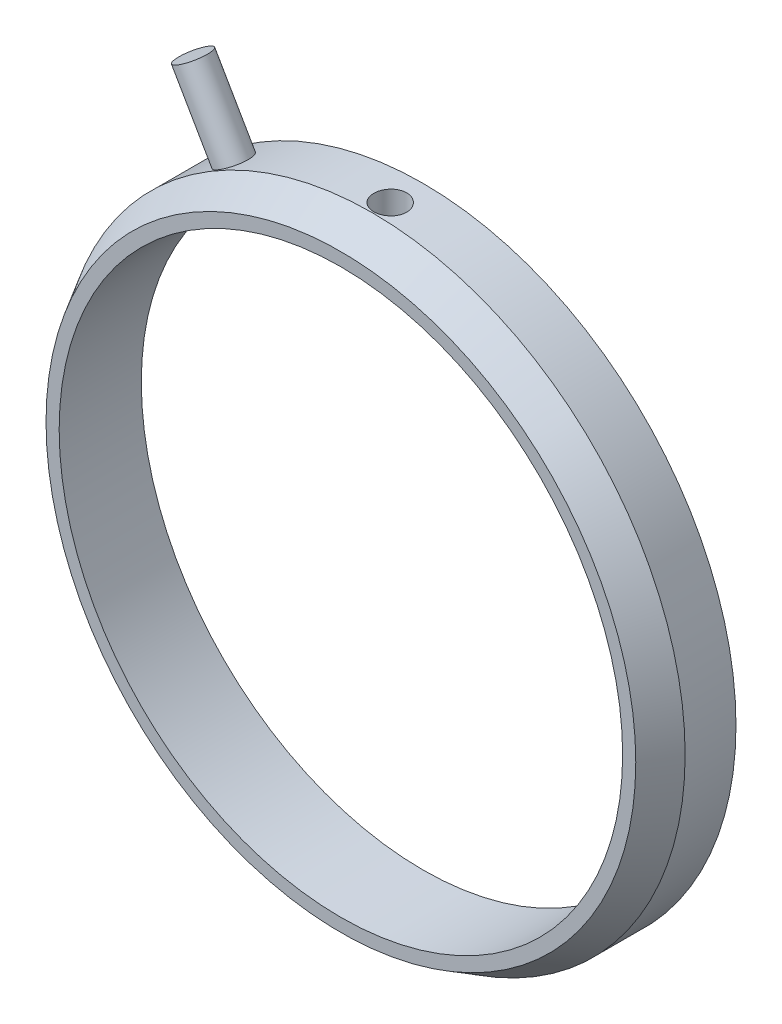
ISO-10303-21;
HEADER;
FILE_DESCRIPTION(('STEP AP214'),'2;1');
FILE_NAME('part.step','',(''),(''),'','','');
FILE_SCHEMA(('AUTOMOTIVE_DESIGN { 1 0 10303 214 1 1 1 1 }'));
ENDSEC;
DATA;
#1=APPLICATION_CONTEXT('core data for automotive mechanical design processes');
#2=APPLICATION_PROTOCOL_DEFINITION('international standard','automotive_design',2000,#1);
#3=PRODUCT_CONTEXT('',#1,'mechanical');
#4=PRODUCT('Part','Part','',(#3));
#5=PRODUCT_RELATED_PRODUCT_CATEGORY('part','',(#4));
#6=PRODUCT_DEFINITION_FORMATION('','',#4);
#7=PRODUCT_DEFINITION_CONTEXT('part definition',#1,'design');
#8=PRODUCT_DEFINITION('design','',#6,#7);
#9=PRODUCT_DEFINITION_SHAPE('','',#8);
#10=(LENGTH_UNIT() NAMED_UNIT(*) SI_UNIT(.MILLI.,.METRE.));
#11=(NAMED_UNIT(*) PLANE_ANGLE_UNIT() SI_UNIT($,.RADIAN.));
#12=(NAMED_UNIT(*) SI_UNIT($,.STERADIAN.) SOLID_ANGLE_UNIT());
#13=UNCERTAINTY_MEASURE_WITH_UNIT(LENGTH_MEASURE(1.E-05),#10,'distance_accuracy_value','');
#14=(GEOMETRIC_REPRESENTATION_CONTEXT(3) GLOBAL_UNCERTAINTY_ASSIGNED_CONTEXT((#13)) GLOBAL_UNIT_ASSIGNED_CONTEXT((#10,
#11,#12)) REPRESENTATION_CONTEXT('',''));
#15=CARTESIAN_POINT('',(0.,0.,0.));
#16=DIRECTION('',(0.,0.,1.));
#17=DIRECTION('',(1.,0.,0.));
#18=AXIS2_PLACEMENT_3D('',#15,#16,#17);
#19=CARTESIAN_POINT('',(0.,0.,5.));
#20=DIRECTION('',(0.,0.,-1.));
#21=DIRECTION('',(-1.,0.,0.));
#22=AXIS2_PLACEMENT_3D('',#19,#20,#21);
#23=CYLINDRICAL_SURFACE('',#22,19.05);
#24=CARTESIAN_POINT('',(0.,0.,0.));
#25=DIRECTION('',(0.,0.,1.));
#26=DIRECTION('',(1.,0.,0.));
#27=AXIS2_PLACEMENT_3D('',#24,#25,#26);
#28=CIRCLE('',#27,19.05);
#29=CARTESIAN_POINT('',(19.05,0.,0.));
#30=VERTEX_POINT('',#29);
#31=EDGE_CURVE('E48',#30,#30,#28,.T.);
#32=ORIENTED_EDGE('',*,*,#31,.T.);
#33=EDGE_LOOP('',(#32));
#34=FACE_BOUND('',#33,.T.);
#35=CARTESIAN_POINT('',(0.,0.,3.09499999999997));
#36=DIRECTION('',(0.,0.,1.));
#37=DIRECTION('',(1.,0.,0.));
#38=AXIS2_PLACEMENT_3D('',#35,#36,#37);
#39=CIRCLE('',#38,19.05);
#40=CARTESIAN_POINT('',(19.05,0.,3.09499999999997));
#41=VERTEX_POINT('',#40);
#42=EDGE_CURVE('E10',#41,#41,#39,.F.);
#43=ORIENTED_EDGE('',*,*,#42,.T.);
#44=EDGE_LOOP('',(#43));
#45=FACE_BOUND('',#44,.T.);
#46=CARTESIAN_POINT('',(-8.64584218360343,16.9750379362234,2.));
#47=CARTESIAN_POINT('',(-8.64584450405685,16.975037003611,2.0561289057362));
#48=CARTESIAN_POINT('',(-8.65007403037411,16.9728846005362,2.11229752510446));
#49=CARTESIAN_POINT('',(-8.66687600559052,16.964310944676,2.22308500091577));
#50=CARTESIAN_POINT('',(-8.67945826286565,16.9578846731915,2.2777019565627));
#51=CARTESIAN_POINT('',(-8.71257345166714,16.9408945502945,2.3837652219365));
#52=CARTESIAN_POINT('',(-8.73310230401211,16.9303328216812,2.43521314272607));
#53=CARTESIAN_POINT('',(-8.78147454131273,16.9052933426343,2.53349416249286));
#54=CARTESIAN_POINT('',(-8.80931620908948,16.8908165115127,2.58032834131314));
#55=CARTESIAN_POINT('',(-8.87149949212673,16.8582391216999,2.66811786934437));
#56=CARTESIAN_POINT('',(-8.90584735882435,16.8401350768513,2.70906749732055));
#57=CARTESIAN_POINT('',(-8.97999202291283,16.8007143418748,2.78387669573688));
#58=CARTESIAN_POINT('',(-9.0197890434879,16.7793975201558,2.8177359756297));
#59=CARTESIAN_POINT('',(-9.1036684852791,16.7340369084404,2.8774194472231));
#60=CARTESIAN_POINT('',(-9.14775329327772,16.7099915983846,2.90323912972492));
#61=CARTESIAN_POINT('',(-9.23888777391661,16.6597766097829,2.94608155464769));
#62=CARTESIAN_POINT('',(-9.28593742242764,16.6336069485253,2.96310436865119));
#63=CARTESIAN_POINT('',(-9.38158336077144,16.5798491771845,2.9878545831941));
#64=CARTESIAN_POINT('',(-9.43017817032903,16.552262409975,2.9955906205787));
#65=CARTESIAN_POINT('',(-9.52755699016301,16.4964028820556,3.00157434175866));
#66=CARTESIAN_POINT('',(-9.57634099882991,16.4681301271705,2.99982210609356));
#67=CARTESIAN_POINT('',(-9.67266686238495,16.4117375179406,2.98688617959907));
#68=CARTESIAN_POINT('',(-9.72020989388284,16.3836175403841,2.97571178390859));
#69=CARTESIAN_POINT('',(-9.81278026987002,16.3283419738842,2.94426314917834));
#70=CARTESIAN_POINT('',(-9.8578076030191,16.3011863892883,2.92398886912199));
#71=CARTESIAN_POINT('',(-9.94413619528007,16.2486680161096,2.8749053930548));
#72=CARTESIAN_POINT('',(-9.98543559401955,16.2233061239952,2.84609196608894));
#73=CARTESIAN_POINT('',(-10.063171833499,16.1752021783766,2.78075119123414));
#74=CARTESIAN_POINT('',(-10.0996086361903,16.1524601453724,2.74422378299099));
#75=CARTESIAN_POINT('',(-10.1666934634213,16.1103202558687,2.664439386183));
#76=CARTESIAN_POINT('',(-10.197334451711,16.090926466673,2.6211743326237));
#77=CARTESIAN_POINT('',(-10.2519667399259,16.05617419228,2.52917109970829));
#78=CARTESIAN_POINT('',(-10.2759580379447,16.0408157082396,2.48043291878299));
#79=CARTESIAN_POINT('',(-10.3166644640985,16.0146658587025,2.37886197642087));
#80=CARTESIAN_POINT('',(-10.3333793275624,16.0038746593352,2.32602906612576));
#81=CARTESIAN_POINT('',(-10.3590955856986,15.9872410131244,2.21777064042261));
#82=CARTESIAN_POINT('',(-10.368097044316,15.9813985252553,2.16234514651147));
#83=CARTESIAN_POINT('',(-10.378146173392,15.9748746045995,2.05054569418397));
#84=CARTESIAN_POINT('',(-10.3792033219369,15.9741870216734,1.99417294644638));
#85=CARTESIAN_POINT('',(-10.3733613839239,15.9779812636581,1.88201695458764));
#86=CARTESIAN_POINT('',(-10.3664623264143,15.9824630696951,1.82623370831494));
#87=CARTESIAN_POINT('',(-10.3448934480343,15.9964321893071,1.71687193430136));
#88=CARTESIAN_POINT('',(-10.3302279789512,16.005916699683,1.6632921899636));
#89=CARTESIAN_POINT('',(-10.2935098548233,16.0295548555754,1.5598208613269));
#90=CARTESIAN_POINT('',(-10.2714571526049,16.0437085309084,1.50992930058255));
#91=CARTESIAN_POINT('',(-10.2205143096018,16.0762090528333,1.41519868169351));
#92=CARTESIAN_POINT('',(-10.1916177081433,16.0945598609738,1.37036445709938));
#93=CARTESIAN_POINT('',(-10.1277556835782,16.1348221524974,1.28706982348367));
#94=CARTESIAN_POINT('',(-10.092790217933,16.1567336608385,1.24860945914218));
#95=CARTESIAN_POINT('',(-10.0176789263744,16.20341205562,1.17911634224705));
#96=CARTESIAN_POINT('',(-9.97752807451036,16.2281817098122,1.14809088041394));
#97=CARTESIAN_POINT('',(-9.89315200851587,16.2797569058419,1.09439811749379));
#98=CARTESIAN_POINT('',(-9.84892681347247,16.3065624381419,1.07173077725396));
#99=CARTESIAN_POINT('',(-9.75763417155323,16.3613540296044,1.03541043658926));
#100=CARTESIAN_POINT('',(-9.71056820616248,16.3893394711776,1.02175278112457));
#101=CARTESIAN_POINT('',(-9.61488154678596,16.4456569784402,1.00382425817753));
#102=CARTESIAN_POINT('',(-9.56626086275912,16.4739890419084,0.999553330579733));
#103=CARTESIAN_POINT('',(-9.46889804430698,16.5301429022431,1.0005200699315));
#104=CARTESIAN_POINT('',(-9.42015612631292,16.5579652718876,1.00574630573203));
#105=CARTESIAN_POINT('',(-9.32388806530134,16.6123649547313,1.02553537477095));
#106=CARTESIAN_POINT('',(-9.27636192454978,16.63894226561,1.04009822540962));
#107=CARTESIAN_POINT('',(-9.18390395053729,16.6901528889411,1.07814474721048));
#108=CARTESIAN_POINT('',(-9.13897213064308,16.7147861913778,1.10162846433099));
#109=CARTESIAN_POINT('',(-9.0530224188041,16.7614939830136,1.15684821680968));
#110=CARTESIAN_POINT('',(-9.01200441016018,16.7835685485115,1.1885840060085));
#111=CARTESIAN_POINT('',(-8.93505463018503,16.824660679055,1.25944830035727));
#112=CARTESIAN_POINT('',(-8.89912846690076,16.8436748765552,1.29858484753192));
#113=CARTESIAN_POINT('',(-8.83348667847128,16.8781928076115,1.38313303650371));
#114=CARTESIAN_POINT('',(-8.80377258202289,16.8936956771604,1.42854621833042));
#115=CARTESIAN_POINT('',(-8.75144325507363,16.920863271904,1.52439720982123));
#116=CARTESIAN_POINT('',(-8.72883522774815,16.9325241031318,1.57484005010712));
#117=CARTESIAN_POINT('',(-8.69147495653263,16.9517317260801,1.67924469157412));
#118=CARTESIAN_POINT('',(-8.67671344783123,16.9592833699924,1.73320225780374));
#119=CARTESIAN_POINT('',(-8.65936734986127,16.9681439777717,1.82291178931079));
#120=CARTESIAN_POINT('',(-8.65430236960244,16.9707267120743,1.8580828945529));
#121=CARTESIAN_POINT('',(-8.64753905234787,16.9741739861786,1.92883067700667));
#122=CARTESIAN_POINT('',(-8.64584071214989,16.9750385276146,1.96440735383253));
#123=CARTESIAN_POINT('',(-8.64584218360343,16.9750379362234,2.));
#124=B_SPLINE_CURVE_WITH_KNOTS('',3,(#46,#47,#48,#49,#50,#51,#52,#53,#54,#55,#56,#57,#58,#59,
#60,#61,#62,#63,#64,#65,#66,#67,#68,#69,#70,#71,#72,#73,#74,#75,#76,#77,#78,#79,#80,#81,#82,#83,
#84,#85,#86,#87,#88,#89,#90,#91,#92,#93,#94,#95,#96,#97,#98,#99,#100,#101,#102,#103,#104,#105,
#106,#107,#108,#109,#110,#111,#112,#113,#114,#115,#116,#117,#118,#119,#120,#121,#122,#123),
.UNSPECIFIED.,.T.,.F.,(4,2,2,2,2,2,2,2,2,2,2,2,2,2,2,2,2,2,2,2,2,2,2,2,2,2,2,2,2,2,2,2,2,2,2,2,
2,2,4),(0.,0.168256788817058,0.336711507150134,0.50507986798654,0.673408728233228,
0.841900154166144,1.01039848316733,1.17899114892286,1.34758244277151,1.51601682234987,
1.68444977220491,1.8527167539162,2.02098449407707,2.18933574690177,2.35768831695577,
2.52624397717676,2.69479968572399,2.86336152476057,3.03192196638344,3.20028127229866,
3.36863996352995,3.53690441726553,3.70516994553007,3.87359495487425,4.04202114480964,
4.21061182500112,4.37920171543634,4.54770443205609,4.71620606953005,4.88450502630892,
5.05280429674092,5.22110443422475,5.38939955189004,5.55787860920835,5.72639907802879,
5.89508982336479,6.06358094140649,6.17027659077638,6.27697213866014),.UNSPECIFIED.);
#125=CARTESIAN_POINT('',(-8.64584218360343,16.9750379362234,2.));
#126=VERTEX_POINT('',#125);
#127=EDGE_CURVE('E52',#126,#126,#124,.T.);
#128=ORIENTED_EDGE('',*,*,#127,.T.);
#129=EDGE_LOOP('',(#128));
#130=FACE_BOUND('',#129,.T.);
#131=CARTESIAN_POINT('',(0.,19.05,1.));
#132=CARTESIAN_POINT('',(-0.056128965819115,19.0499996492509,1.00000247582322));
#133=CARTESIAN_POINT('',(-0.1122976450661,19.0497492761118,1.00474156439992));
#134=CARTESIAN_POINT('',(-0.22308524529656,19.0487745579962,1.02357937218007));
#135=CARTESIAN_POINT('',(-0.277702265530772,19.0480496558193,1.03768909483223));
#136=CARTESIAN_POINT('',(-0.383765667431645,19.0462079189646,1.07486284604117));
#137=CARTESIAN_POINT('',(-0.435213659613883,19.0450912853312,1.09792228207273));
#138=CARTESIAN_POINT('',(-0.533494798831342,19.0425918146023,1.15233375881423));
#139=CARTESIAN_POINT('',(-0.580329025800057,19.0412090400268,1.18368385258864));
#140=CARTESIAN_POINT('',(-0.668118498763355,19.0383311198399,1.25382493751799));
#141=CARTESIAN_POINT('',(-0.70906803894086,19.0368358672805,1.29262306632868));
#142=CARTESIAN_POINT('',(-0.783877068104641,19.0339024354037,1.37654452222381));
#143=CARTESIAN_POINT('',(-0.81773626627465,19.0324642584292,1.42166810862547));
#144=CARTESIAN_POINT('',(-0.877419652955399,19.0298063834236,1.51699009419832));
#145=CARTESIAN_POINT('',(-0.903239317106016,19.0285868085771,1.56719132991168));
#146=CARTESIAN_POINT('',(-0.94608170339076,19.0265049895885,1.67122363665503));
#147=CARTESIAN_POINT('',(-0.963104497329709,19.0256427425298,1.72505467805252));
#148=CARTESIAN_POINT('',(-0.987854669137189,19.0243737926551,1.83476543425953));
#149=CARTESIAN_POINT('',(-0.995590682372487,19.0239666666666,1.89064319600266));
#150=CARTESIAN_POINT('',(-1.00157434189332,19.0236526001301,2.00290556703834));
#151=CARTESIAN_POINT('',(-0.999822068973586,19.023745655323,2.05929017201094));
#152=CARTESIAN_POINT('',(-0.986886084087243,19.0244210641979,2.17090695562115));
#153=CARTESIAN_POINT('',(-0.975711704744838,19.0250029337057,2.22614021921235));
#154=CARTESIAN_POINT('',(-0.944263171657054,19.0265896279527,2.33394591165135));
#155=CARTESIAN_POINT('',(-0.923988976530578,19.0275944546154,2.38651832839782));
#156=CARTESIAN_POINT('',(-0.874905675091027,19.0299143712327,2.48754004103251));
#157=CARTESIAN_POINT('',(-0.846092317804949,19.0312296156531,2.53598726781468));
#158=CARTESIAN_POINT('',(-0.780751691014567,19.0340219738736,2.62736073298684));
#159=CARTESIAN_POINT('',(-0.744224361199197,19.0354990889392,2.67028692820687));
#160=CARTESIAN_POINT('',(-0.664440019297213,19.0384508592366,2.74945412834148));
#161=CARTESIAN_POINT('',(-0.621174926391026,19.0399255093371,2.78568699013545));
#162=CARTESIAN_POINT('',(-0.529171581902046,19.0427044275829,2.85037624545722));
#163=CARTESIAN_POINT('',(-0.480433328881472,19.0440086956836,2.87883263694215));
#164=CARTESIAN_POINT('',(-0.378862368539876,19.0462999261193,2.9271604152024));
#165=CARTESIAN_POINT('',(-0.326029523662822,19.0472868777886,2.94703151341096));
#166=CARTESIAN_POINT('',(-0.217771239919699,19.0488320942265,2.97761929375591));
#167=CARTESIAN_POINT('',(-0.16234582244066,19.0493903625308,2.98833605139559));
#168=CARTESIAN_POINT('',(-0.0505464031898987,19.050014841573,3.00030089503577));
#169=CARTESIAN_POINT('',(0.0058263901341682,19.0500816375886,3.00156024358073));
#170=CARTESIAN_POINT('',(0.117982482730399,19.0497171986654,2.99460391875666));
#171=CARTESIAN_POINT('',(0.173765784154294,19.0492859655451,2.98638827998479));
#172=CARTESIAN_POINT('',(0.283127819973493,19.0479744114619,2.960724514755));
#173=CARTESIAN_POINT('',(0.33670776545415,19.0470943408686,2.94328153527512));
#174=CARTESIAN_POINT('',(0.440179471751109,19.044984182381,2.89966345052023));
#175=CARTESIAN_POINT('',(0.490071209149917,19.0437540922646,2.87348828980789));
#176=CARTESIAN_POINT('',(0.584801944572769,19.0410807860946,2.81312005424124));
#177=CARTESIAN_POINT('',(0.629636128946193,19.0396373699707,2.77891943472383));
#178=CARTESIAN_POINT('',(0.712930669965442,19.0367006156153,2.70348212708752));
#179=CARTESIAN_POINT('',(0.751390981759502,19.0352072770326,2.6622453894609));
#180=CARTESIAN_POINT('',(0.820883990552941,19.0323373170156,2.57385792918557));
#181=CARTESIAN_POINT('',(0.85190939704309,19.0309608109918,2.5267014702536));
#182=CARTESIAN_POINT('',(0.905602062745278,19.0284815584434,2.42784212158122));
#183=CARTESIAN_POINT('',(0.928269361106871,19.0273788106365,2.37613925313768));
#184=CARTESIAN_POINT('',(0.964589672848669,19.0255722533115,2.26968168058374));
#185=CARTESIAN_POINT('',(0.978247323155721,19.0248682386069,2.21492856208261));
#186=CARTESIAN_POINT('',(0.996175810004851,19.023937962066,2.1039025707151));
#187=CARTESIAN_POINT('',(1.00044670706498,19.0237116971494,2.04762970764917));
#188=CARTESIAN_POINT('',(0.999479880960504,19.0237625113021,1.93523416012142));
#189=CARTESIAN_POINT('',(0.994253625313881,19.0240389833324,1.87911137637988));
#190=CARTESIAN_POINT('',(0.974464566046456,19.0250628285014,1.76854123395058));
#191=CARTESIAN_POINT('',(0.959901744773855,19.0258102025304,1.71409387843061));
#192=CARTESIAN_POINT('',(0.921855333883416,19.0276914799284,1.60841789515962));
#193=CARTESIAN_POINT('',(0.898371698430223,19.0288253852833,1.55718928394817));
#194=CARTESIAN_POINT('',(0.843152151652839,19.0313518960305,1.45940099493089));
#195=CARTESIAN_POINT('',(0.811416486339222,19.0327444937103,1.4128411779957));
#196=CARTESIAN_POINT('',(0.740552325654367,19.0356333650894,1.32565463623174));
#197=CARTESIAN_POINT('',(0.701415760113163,19.0371297508238,1.28503447473866));
#198=CARTESIAN_POINT('',(0.616867496641924,19.0400567163134,1.21092787450082));
#199=CARTESIAN_POINT('',(0.571454258883368,19.0414872798056,1.17744319141116));
#200=CARTESIAN_POINT('',(0.475603224472173,19.0441224780258,1.11854077799506));
#201=CARTESIAN_POINT('',(0.425160407158359,19.045326883469,1.09313121655766));
#202=CARTESIAN_POINT('',(0.320755814925444,19.0473706977857,1.05117241762358));
#203=CARTESIAN_POINT('',(0.266798274828278,19.048210536894,1.03461273077747));
#204=CARTESIAN_POINT('',(0.17708868053263,19.0492088229126,1.01516019767389));
#205=CARTESIAN_POINT('',(0.141917481584792,19.049504207771,1.00948239852566));
#206=CARTESIAN_POINT('',(0.0711695112718891,19.0498999074317,1.00190151648576));
#207=CARTESIAN_POINT('',(0.0355927402908323,19.0500002224185,0.999998430020369));
#208=CARTESIAN_POINT('',(0.,19.05,1.));
#209=B_SPLINE_CURVE_WITH_KNOTS('',3,(#131,#132,#133,#134,#135,#136,#137,#138,#139,#140,#141,
#142,#143,#144,#145,#146,#147,#148,#149,#150,#151,#152,#153,#154,#155,#156,#157,#158,#159,#160,
#161,#162,#163,#164,#165,#166,#167,#168,#169,#170,#171,#172,#173,#174,#175,#176,#177,#178,#179,
#180,#181,#182,#183,#184,#185,#186,#187,#188,#189,#190,#191,#192,#193,#194,#195,#196,#197,#198,
#199,#200,#201,#202,#203,#204,#205,#206,#207,#208),.UNSPECIFIED.,.T.,.F.,(4,2,2,2,2,2,2,2,2,2,2,
2,2,2,2,2,2,2,2,2,2,2,2,2,2,2,2,2,2,2,2,2,2,2,2,2,2,2,4),(0.,0.168256969261905,
0.336711864103029,0.505080430742383,0.673409493627838,0.84190068350783,1.01039878284092,
1.17899153616361,1.34758291331912,1.51601740307732,1.68445045858295,1.85271687636543,
2.02098405934135,2.18933515034394,2.35768755763455,2.52624345292151,2.69479939248767,
2.86336099707389,3.03192121138209,3.20028066051362,3.36863949489613,3.53690451818415,
3.70517060974353,3.87359552501932,4.04202162541981,4.21061221118078,4.37920200724986,
4.5477049686605,4.71620684369966,4.88450539311582,5.05280426071974,5.2211039930589,
5.38939870859991,5.55787800728042,5.72639871185763,5.89508935528817,6.06358037737042,
6.17027630863372,6.27697213888225),.UNSPECIFIED.);
#210=CARTESIAN_POINT('',(0.,19.05,1.));
#211=VERTEX_POINT('',#210);
#212=EDGE_CURVE('E58',#211,#211,#209,.T.);
#213=ORIENTED_EDGE('',*,*,#212,.F.);
#214=EDGE_LOOP('',(#213));
#215=FACE_BOUND('',#214,.T.);
#216=ADVANCED_FACE('F31',(#34,#45,#130,#215),#23,.T.);
#217=CARTESIAN_POINT('',(0.,0.,5.));
#218=DIRECTION('',(0.,0.,1.));
#219=DIRECTION('',(1.,0.,0.));
#220=AXIS2_PLACEMENT_3D('',#217,#218,#219);
#221=PLANE('',#220);
#222=CARTESIAN_POINT('',(0.,0.,5.));
#223=DIRECTION('',(0.,0.,1.));
#224=DIRECTION('',(1.,0.,0.));
#225=AXIS2_PLACEMENT_3D('',#222,#223,#224);
#226=CIRCLE('',#225,17.15);
#227=CARTESIAN_POINT('',(17.15,0.,5.));
#228=VERTEX_POINT('',#227);
#229=EDGE_CURVE('E100',#228,#228,#226,.T.);
#230=ORIENTED_EDGE('',*,*,#229,.F.);
#231=EDGE_LOOP('',(#230));
#232=FACE_BOUND('',#231,.T.);
#233=CARTESIAN_POINT('',(0.,0.,5.));
#234=DIRECTION('',(0.,0.,1.));
#235=DIRECTION('',(1.,0.,0.));
#236=AXIS2_PLACEMENT_3D('',#233,#234,#235);
#237=CIRCLE('',#236,17.9501477371937);
#238=CARTESIAN_POINT('',(17.9501477371937,0.,5.));
#239=VERTEX_POINT('',#238);
#240=EDGE_CURVE('E43',#239,#239,#237,.T.);
#241=ORIENTED_EDGE('',*,*,#240,.T.);
#242=EDGE_LOOP('',(#241));
#243=FACE_BOUND('',#242,.T.);
#244=ADVANCED_FACE('F70',(#232,#243),#221,.T.);
#245=CARTESIAN_POINT('',(0.,0.,0.));
#246=DIRECTION('',(0.,0.,1.));
#247=DIRECTION('',(1.,0.,0.));
#248=AXIS2_PLACEMENT_3D('',#245,#246,#247);
#249=PLANE('',#248);
#250=CARTESIAN_POINT('',(0.,0.,0.));
#251=DIRECTION('',(0.,0.,1.));
#252=DIRECTION('',(1.,0.,0.));
#253=AXIS2_PLACEMENT_3D('',#250,#251,#252);
#254=CIRCLE('',#253,17.15);
#255=CARTESIAN_POINT('',(17.15,0.,0.));
#256=VERTEX_POINT('',#255);
#257=EDGE_CURVE('E94',#256,#256,#254,.T.);
#258=ORIENTED_EDGE('',*,*,#257,.T.);
#259=EDGE_LOOP('',(#258));
#260=FACE_BOUND('',#259,.T.);
#261=ORIENTED_EDGE('',*,*,#31,.F.);
#262=EDGE_LOOP('',(#261));
#263=FACE_BOUND('',#262,.T.);
#264=ADVANCED_FACE('F72',(#260,#263),#249,.F.);
#265=CARTESIAN_POINT('',(0.,0.,5.));
#266=DIRECTION('',(0.,0.,-1.));
#267=DIRECTION('',(-1.,0.,0.));
#268=AXIS2_PLACEMENT_3D('',#265,#266,#267);
#269=CONICAL_SURFACE('',#268,17.9501477371937,0.523598775598297);
#270=ORIENTED_EDGE('',*,*,#42,.F.);
#271=EDGE_LOOP('',(#270));
#272=FACE_BOUND('',#271,.T.);
#273=ORIENTED_EDGE('',*,*,#240,.F.);
#274=EDGE_LOOP('',(#273));
#275=FACE_BOUND('',#274,.T.);
#276=ADVANCED_FACE('F33',(#272,#275),#269,.T.);
#277=CARTESIAN_POINT('',(0.,0.,2.));
#278=DIRECTION('',(0.5,-0.866025403784439,0.));
#279=DIRECTION('',(0.866025403784439,0.5,0.));
#280=AXIS2_PLACEMENT_3D('',#277,#278,#279);
#281=CYLINDRICAL_SURFACE('',#280,1.);
#282=CARTESIAN_POINT('',(-12.,20.7846096908265,2.));
#283=DIRECTION('',(0.5,-0.866025403784439,0.));
#284=DIRECTION('',(0.866025403784439,0.5,0.));
#285=AXIS2_PLACEMENT_3D('',#282,#283,#284);
#286=CIRCLE('',#285,1.);
#287=CARTESIAN_POINT('',(-11.1339745962156,21.2846096908265,2.));
#288=VERTEX_POINT('',#287);
#289=EDGE_CURVE('E57',#288,#288,#286,.T.);
#290=ORIENTED_EDGE('',*,*,#289,.T.);
#291=EDGE_LOOP('',(#290));
#292=FACE_BOUND('',#291,.T.);
#293=ORIENTED_EDGE('',*,*,#127,.F.);
#294=EDGE_LOOP('',(#293));
#295=FACE_BOUND('',#294,.T.);
#296=ADVANCED_FACE('F63',(#292,#295),#281,.T.);
#297=CARTESIAN_POINT('',(-12.,20.7846096908265,2.));
#298=DIRECTION('',(0.5,-0.866025403784439,0.));
#299=DIRECTION('',(0.866025403784439,0.5,0.));
#300=AXIS2_PLACEMENT_3D('',#297,#298,#299);
#301=PLANE('',#300);
#302=ORIENTED_EDGE('',*,*,#289,.F.);
#303=EDGE_LOOP('',(#302));
#304=FACE_BOUND('',#303,.T.);
#305=ADVANCED_FACE('F68',(#304),#301,.F.);
#306=CARTESIAN_POINT('',(0.,30.,2.));
#307=DIRECTION('',(0.,-1.,0.));
#308=DIRECTION('',(0.,0.,-1.));
#309=AXIS2_PLACEMENT_3D('',#306,#307,#308);
#310=CYLINDRICAL_SURFACE('',#309,1.);
#311=CARTESIAN_POINT('',(0.,17.15,1.));
#312=CARTESIAN_POINT('',(-0.0561192802153644,17.1499996115266,1.00000247199935));
#313=CARTESIAN_POINT('',(-0.112278036219131,17.1497215971962,1.00473993179034));
#314=CARTESIAN_POINT('',(-0.223045399459325,17.1486392705558,1.02357089249119));
#315=CARTESIAN_POINT('',(-0.277652116549697,17.1478343429839,1.0376753312404));
#316=CARTESIAN_POINT('',(-0.383694862399309,17.1457892651121,1.07483422488781));
#317=CARTESIAN_POINT('',(-0.435132527175232,17.1445493416292,1.09788401613557));
#318=CARTESIAN_POINT('',(-0.533395049277844,17.1417737964984,1.15227189550646));
#319=CARTESIAN_POINT('',(-0.580220971262658,17.140238243342,1.18360806446762));
#320=CARTESIAN_POINT('',(-0.66800633435598,17.1370418209248,1.253724793318));
#321=CARTESIAN_POINT('',(-0.708958887740516,17.1353808079642,1.29251397071148));
#322=CARTESIAN_POINT('',(-0.783776179437769,17.1321219026696,1.37641802981335));
#323=CARTESIAN_POINT('',(-0.817640623993646,17.1305240129539,1.42153317356329));
#324=CARTESIAN_POINT('',(-0.877341001829057,17.1275704654809,1.51684670154599));
#325=CARTESIAN_POINT('',(-0.903171310642352,17.1262149777031,1.56704861442819));
#326=CARTESIAN_POINT('',(-0.94603417440478,17.1239009210461,1.6710858632696));
#327=CARTESIAN_POINT('',(-0.963066813920606,17.1229423483516,1.72492116429762));
#328=CARTESIAN_POINT('',(-0.987831987706541,17.1215315687964,1.83463148358184));
#329=CARTESIAN_POINT('',(-0.995575176479469,17.1210787818676,1.89050408919262));
#330=CARTESIAN_POINT('',(-1.00157453275548,17.1207288959441,2.00275773158442));
#331=CARTESIAN_POINT('',(-0.999830795968045,17.1208317913432,2.05913876323044));
#332=CARTESIAN_POINT('',(-0.986914651303406,17.1215811278734,2.17073627311292));
#333=CARTESIAN_POINT('',(-0.975753766252402,17.1222269047311,2.2259540900651));
#334=CARTESIAN_POINT('',(-0.944338008812869,17.1239881792722,2.33373115659339));
#335=CARTESIAN_POINT('',(-0.924083087705476,17.1251036794722,2.38629039192519));
#336=CARTESIAN_POINT('',(-0.875041111377438,17.1276794499728,2.48729538949241));
#337=CARTESIAN_POINT('',(-0.846248819591822,17.1291399317627,2.53573860355401));
#338=CARTESIAN_POINT('',(-0.780953210596635,17.1322408570482,2.62710857168092));
#339=CARTESIAN_POINT('',(-0.744449818308336,17.133881302296,2.67003527202844));
#340=CARTESIAN_POINT('',(-0.664703261666482,17.1371602282636,2.74922073169108));
#341=CARTESIAN_POINT('',(-0.621450122892072,17.1387987024007,2.78546944694227));
#342=CARTESIAN_POINT('',(-0.529466869213145,17.1418866769614,2.85019252219546));
#343=CARTESIAN_POINT('',(-0.48073675261658,17.1433361773266,2.87866687979564));
#344=CARTESIAN_POINT('',(-0.379176797799557,17.1458829547207,2.92703206682111));
#345=CARTESIAN_POINT('',(-0.32634678313969,17.1469802165804,2.94692252659578));
#346=CARTESIAN_POINT('',(-0.218089361671701,17.1486986553217,2.97754864342065));
#347=CARTESIAN_POINT('',(-0.162661981281587,17.1493198370443,2.98828439356281));
#348=CARTESIAN_POINT('',(-0.0508703715965819,17.1500154909644,3.00028392083737));
#349=CARTESIAN_POINT('',(0.00549236210981455,17.1500907648124,3.00156158696168));
#350=CARTESIAN_POINT('',(0.117631374009308,17.1496882511757,2.99464495185245));
#351=CARTESIAN_POINT('',(0.173407654852143,17.1492104661908,2.98645069343398));
#352=CARTESIAN_POINT('',(0.282751425783799,17.1477561473761,2.96083431256235));
#353=CARTESIAN_POINT('',(0.336320411110414,17.146779957378,2.94341855138705));
#354=CARTESIAN_POINT('',(0.4397750826824,17.1444386821697,2.89985999091618));
#355=CARTESIAN_POINT('',(0.48966074006718,17.1430735939127,2.87371712324853));
#356=CARTESIAN_POINT('',(0.584396349545589,17.1401059753633,2.81341102022845));
#357=CARTESIAN_POINT('',(0.62924038015306,17.1385031708866,2.77923849643092));
#358=CARTESIAN_POINT('',(0.712560194226413,17.1352414628807,2.70385665176281));
#359=CARTESIAN_POINT('',(0.751035922876549,17.133582558869,2.66264727032803));
#360=CARTESIAN_POINT('',(0.820573893434011,17.1303933136999,2.57430163312227));
#361=CARTESIAN_POINT('',(0.851627133555458,17.1288631300933,2.52715828547103));
#362=CARTESIAN_POINT('',(0.905377083948977,17.1261063806698,2.42831865285461));
#363=CARTESIAN_POINT('',(0.928073840321318,17.1248798131781,2.37662239300844));
#364=CARTESIAN_POINT('',(0.964450918299353,17.1228697484375,2.27017745184643));
#365=CARTESIAN_POINT('',(0.978136931809287,17.1220859715313,2.21543072120574));
#366=CARTESIAN_POINT('',(0.996122627341088,17.1210490951983,2.10441172923583));
#367=CARTESIAN_POINT('',(1.00042238813559,17.1207959913179,2.0481394807133));
#368=CARTESIAN_POINT('',(0.99951277648272,17.1208491113592,1.93575635178937));
#369=CARTESIAN_POINT('',(0.994317558958277,17.1211545026881,1.87964535587674));
#370=CARTESIAN_POINT('',(0.974594780342892,17.1222884346755,1.76909377219519));
#371=CARTESIAN_POINT('',(0.96006720200065,17.1231169763012,1.7146531875143));
#372=CARTESIAN_POINT('',(0.922095179433174,17.1252036361014,1.6089853928917));
#373=CARTESIAN_POINT('',(0.898650746573526,17.1264617537283,1.55775817885428));
#374=CARTESIAN_POINT('',(0.843512600636732,17.1292657509829,1.45996544881487));
#375=CARTESIAN_POINT('',(0.811819115400689,17.1308116226623,1.41339980410823));
#376=CARTESIAN_POINT('',(0.7410306259772,17.1340195847632,1.32618054867878));
#377=CARTESIAN_POINT('',(0.701925486958458,17.1356818323331,1.28553516962731));
#378=CARTESIAN_POINT('',(0.617435510395111,17.1389339431478,1.21137249834172));
#379=CARTESIAN_POINT('',(0.572049135768406,17.140523788548,1.17785695595988));
#380=CARTESIAN_POINT('',(0.476239179375722,17.1434533962508,1.118883928262));
#381=CARTESIAN_POINT('',(0.425809933746281,17.1447928723987,1.0934356404259));
#382=CARTESIAN_POINT('',(0.321423767474143,17.1470668296202,1.05139811145201));
#383=CARTESIAN_POINT('',(0.267471075182486,17.1480017862246,1.03479846298735));
#384=CARTESIAN_POINT('',(0.177655367713526,17.1491155230348,1.01525811594562));
#385=CARTESIAN_POINT('',(0.142373353161419,17.1494457337587,1.00954368737621));
#386=CARTESIAN_POINT('',(0.0713995527593519,17.1498880957014,1.0019138452135));
#387=CARTESIAN_POINT('',(0.0357077673961613,17.1500002471792,0.999998427107804));
#388=CARTESIAN_POINT('',(0.,17.15,1.));
#389=B_SPLINE_CURVE_WITH_KNOTS('',3,(#311,#312,#313,#314,#315,#316,#317,#318,#319,#320,#321,
#322,#323,#324,#325,#326,#327,#328,#329,#330,#331,#332,#333,#334,#335,#336,#337,#338,#339,#340,
#341,#342,#343,#344,#345,#346,#347,#348,#349,#350,#351,#352,#353,#354,#355,#356,#357,#358,#359,
#360,#361,#362,#363,#364,#365,#366,#367,#368,#369,#370,#371,#372,#373,#374,#375,#376,#377,#378,
#379,#380,#381,#382,#383,#384,#385,#386,#387,#388),.UNSPECIFIED.,.T.,.F.,(4,2,2,2,2,2,2,2,2,2,2,
2,2,2,2,2,2,2,2,2,2,2,2,2,2,2,2,2,2,2,2,2,2,2,2,2,2,2,4),(0.,0.16822748894977,0.336651763671793,
0.504988348273766,0.673285979468741,0.841779387884489,1.01027977789383,1.17889786602181,
1.34751433329558,1.51593722104711,1.68435840965614,1.85257381638578,2.0207901242952,
2.18910982519041,2.35743116499716,2.52600363871526,2.69457616451198,2.86315594886678,
3.03173401895568,3.2000644865936,3.36839419334566,3.53660793205181,3.70482298865116,
3.87323359730984,4.04164565550296,4.21026093441683,4.37887528311573,4.5473830190861,
4.71588934087659,4.884144661704,5.05240029356007,5.22065571095517,5.38890648158227,
5.55738900332693,5.72591282759745,5.89462810063913,6.06314449892761,6.17018498763436,
6.27722534920004),.UNSPECIFIED.);
#390=CARTESIAN_POINT('',(0.,17.15,1.));
#391=VERTEX_POINT('',#390);
#392=EDGE_CURVE('E35',#391,#391,#389,.T.);
#393=ORIENTED_EDGE('',*,*,#392,.F.);
#394=EDGE_LOOP('',(#393));
#395=FACE_BOUND('',#394,.T.);
#396=ORIENTED_EDGE('',*,*,#212,.T.);
#397=EDGE_LOOP('',(#396));
#398=FACE_BOUND('',#397,.T.);
#399=ADVANCED_FACE('F111',(#395,#398),#310,.F.);
#400=CARTESIAN_POINT('',(0.,0.,-10.));
#401=DIRECTION('',(0.,0.,1.));
#402=DIRECTION('',(1.,0.,0.));
#403=AXIS2_PLACEMENT_3D('',#400,#401,#402);
#404=CYLINDRICAL_SURFACE('',#403,17.15);
#405=ORIENTED_EDGE('',*,*,#229,.T.);
#406=EDGE_LOOP('',(#405));
#407=FACE_BOUND('',#406,.T.);
#408=ORIENTED_EDGE('',*,*,#392,.T.);
#409=EDGE_LOOP('',(#408));
#410=FACE_BOUND('',#409,.T.);
#411=ORIENTED_EDGE('',*,*,#257,.F.);
#412=EDGE_LOOP('',(#411));
#413=FACE_BOUND('',#412,.T.);
#414=ADVANCED_FACE('F105',(#407,#410,#413),#404,.F.);
#415=CLOSED_SHELL('',(#216,#244,#264,#276,#296,#305,#399,#414));
#416=MANIFOLD_SOLID_BREP('B2',#415);
#417=ADVANCED_BREP_SHAPE_REPRESENTATION('',(#18,#416),#14);
#418=SHAPE_DEFINITION_REPRESENTATION(#9,#417);
ENDSEC;
END-ISO-10303-21;
